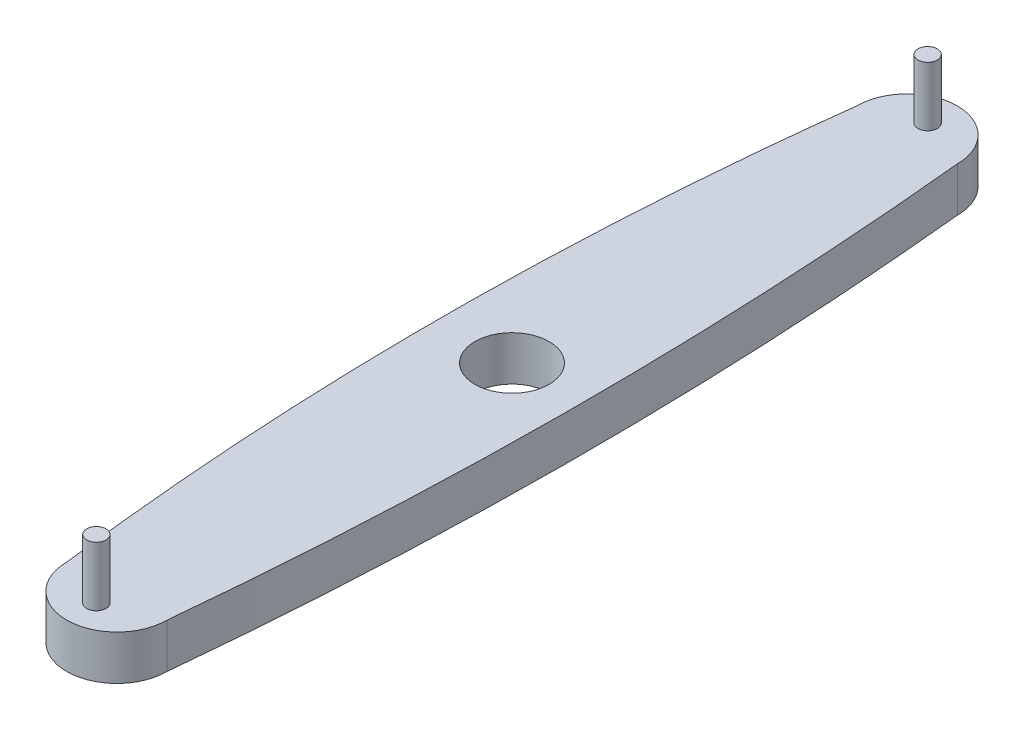
ISO-10303-21;
HEADER;
FILE_DESCRIPTION(('STEP AP214'),'2;1');
FILE_NAME('part.step','',(''),(''),'','','');
FILE_SCHEMA(('AUTOMOTIVE_DESIGN { 1 0 10303 214 1 1 1 1 }'));
ENDSEC;
DATA;
#1=APPLICATION_CONTEXT('core data for automotive mechanical design processes');
#2=APPLICATION_PROTOCOL_DEFINITION('international standard','automotive_design',2000,#1);
#3=PRODUCT_CONTEXT('',#1,'mechanical');
#4=PRODUCT('Part','Part','',(#3));
#5=PRODUCT_RELATED_PRODUCT_CATEGORY('part','',(#4));
#6=PRODUCT_DEFINITION_FORMATION('','',#4);
#7=PRODUCT_DEFINITION_CONTEXT('part definition',#1,'design');
#8=PRODUCT_DEFINITION('design','',#6,#7);
#9=PRODUCT_DEFINITION_SHAPE('','',#8);
#10=(LENGTH_UNIT() NAMED_UNIT(*) SI_UNIT(.MILLI.,.METRE.));
#11=(NAMED_UNIT(*) PLANE_ANGLE_UNIT() SI_UNIT($,.RADIAN.));
#12=(NAMED_UNIT(*) SI_UNIT($,.STERADIAN.) SOLID_ANGLE_UNIT());
#13=UNCERTAINTY_MEASURE_WITH_UNIT(LENGTH_MEASURE(1.E-05),#10,'distance_accuracy_value','');
#14=(GEOMETRIC_REPRESENTATION_CONTEXT(3) GLOBAL_UNCERTAINTY_ASSIGNED_CONTEXT((#13)) GLOBAL_UNIT_ASSIGNED_CONTEXT((#10,
#11,#12)) REPRESENTATION_CONTEXT('',''));
#15=CARTESIAN_POINT('',(0.,0.,0.));
#16=DIRECTION('',(0.,0.,1.));
#17=DIRECTION('',(1.,0.,0.));
#18=AXIS2_PLACEMENT_3D('',#15,#16,#17);
#19=CARTESIAN_POINT('',(0.,30.,266.179413915618));
#20=DIRECTION('',(0.,-1.,0.));
#21=DIRECTION('',(0.,0.,-1.));
#22=AXIS2_PLACEMENT_3D('',#19,#20,#21);
#23=CYLINDRICAL_SURFACE('',#22,33.8205860843821);
#24=CARTESIAN_POINT('',(0.,0.,266.179413915618));
#25=DIRECTION('',(0.,1.,0.));
#26=DIRECTION('',(0.,0.,-1.));
#27=AXIS2_PLACEMENT_3D('',#24,#25,#26);
#28=CIRCLE('',#27,33.8205860843821);
#29=CARTESIAN_POINT('',(-33.8205860843821,0.,266.179413915618));
#30=VERTEX_POINT('',#29);
#31=CARTESIAN_POINT('',(33.8205860843821,0.,266.179413915618));
#32=VERTEX_POINT('',#31);
#33=EDGE_CURVE('E131',#30,#32,#28,.T.);
#34=ORIENTED_EDGE('',*,*,#33,.T.);
#35=DIRECTION('',(0.,-1.,0.));
#36=VECTOR('',#35,1.);
#37=CARTESIAN_POINT('',(33.8205860843821,30.,266.179413915618));
#38=LINE('',#37,#36);
#39=CARTESIAN_POINT('',(33.8205860843821,30.,266.179413915618));
#40=VERTEX_POINT('',#39);
#41=EDGE_CURVE('E63',#40,#32,#38,.T.);
#42=ORIENTED_EDGE('',*,*,#41,.F.);
#43=CARTESIAN_POINT('',(0.,30.,266.179413915618));
#44=DIRECTION('',(0.,1.,0.));
#45=DIRECTION('',(0.,0.,-1.));
#46=AXIS2_PLACEMENT_3D('',#43,#44,#45);
#47=CIRCLE('',#46,33.8205860843821);
#48=CARTESIAN_POINT('',(-33.8205860843821,30.,266.179413915618));
#49=VERTEX_POINT('',#48);
#50=EDGE_CURVE('E98',#49,#40,#47,.T.);
#51=ORIENTED_EDGE('',*,*,#50,.F.);
#52=DIRECTION('',(0.,-1.,0.));
#53=VECTOR('',#52,1.);
#54=CARTESIAN_POINT('',(-33.8205860843821,30.,266.179413915618));
#55=LINE('',#54,#53);
#56=EDGE_CURVE('E83',#49,#30,#55,.T.);
#57=ORIENTED_EDGE('',*,*,#56,.T.);
#58=EDGE_LOOP('',(#34,#42,#51,#57));
#59=FACE_BOUND('',#58,.T.);
#60=ADVANCED_FACE('F39',(#59),#23,.T.);
#61=CARTESIAN_POINT('',(0.,30.,-266.179413915618));
#62=DIRECTION('',(0.,-1.,0.));
#63=DIRECTION('',(0.,0.,-1.));
#64=AXIS2_PLACEMENT_3D('',#61,#62,#63);
#65=CYLINDRICAL_SURFACE('',#64,33.8205860843821);
#66=CARTESIAN_POINT('',(0.,0.,-266.179413915618));
#67=DIRECTION('',(0.,1.,0.));
#68=DIRECTION('',(0.,0.,1.));
#69=AXIS2_PLACEMENT_3D('',#66,#67,#68);
#70=CIRCLE('',#69,33.8205860843821);
#71=CARTESIAN_POINT('',(33.8205860843821,0.,-266.179413915618));
#72=VERTEX_POINT('',#71);
#73=CARTESIAN_POINT('',(-33.8205860843821,0.,-266.179413915618));
#74=VERTEX_POINT('',#73);
#75=EDGE_CURVE('E103',#72,#74,#70,.T.);
#76=ORIENTED_EDGE('',*,*,#75,.T.);
#77=DIRECTION('',(0.,-1.,0.));
#78=VECTOR('',#77,1.);
#79=CARTESIAN_POINT('',(-33.8205860843821,30.,-266.179413915618));
#80=LINE('',#79,#78);
#81=CARTESIAN_POINT('',(-33.8205860843821,30.,-266.179413915618));
#82=VERTEX_POINT('',#81);
#83=EDGE_CURVE('E55',#82,#74,#80,.T.);
#84=ORIENTED_EDGE('',*,*,#83,.F.);
#85=CARTESIAN_POINT('',(0.,30.,-266.179413915618));
#86=DIRECTION('',(0.,1.,0.));
#87=DIRECTION('',(0.,0.,1.));
#88=AXIS2_PLACEMENT_3D('',#85,#86,#87);
#89=CIRCLE('',#88,33.8205860843821);
#90=CARTESIAN_POINT('',(33.8205860843821,30.,-266.179413915618));
#91=VERTEX_POINT('',#90);
#92=EDGE_CURVE('E93',#91,#82,#89,.T.);
#93=ORIENTED_EDGE('',*,*,#92,.F.);
#94=DIRECTION('',(0.,-1.,0.));
#95=VECTOR('',#94,1.);
#96=CARTESIAN_POINT('',(33.8205860843821,30.,-266.179413915618));
#97=LINE('',#96,#95);
#98=EDGE_CURVE('E105',#91,#72,#97,.T.);
#99=ORIENTED_EDGE('',*,*,#98,.T.);
#100=EDGE_LOOP('',(#76,#84,#93,#99));
#101=FACE_BOUND('',#100,.T.);
#102=ADVANCED_FACE('F101',(#101),#65,.T.);
#103=CARTESIAN_POINT('',(0.,30.,266.179413915618));
#104=DIRECTION('',(0.,-1.,0.));
#105=DIRECTION('',(0.,0.,-1.));
#106=AXIS2_PLACEMENT_3D('',#103,#104,#105);
#107=PLANE('',#106);
#108=CARTESIAN_POINT('',(0.,30.,-280.));
#109=DIRECTION('',(0.,-1.,0.));
#110=DIRECTION('',(0.,0.,-1.));
#111=AXIS2_PLACEMENT_3D('',#108,#109,#110);
#112=CIRCLE('',#111,6.505);
#113=CARTESIAN_POINT('',(0.,30.,-286.505));
#114=VERTEX_POINT('',#113);
#115=EDGE_CURVE('E88',#114,#114,#112,.T.);
#116=ORIENTED_EDGE('',*,*,#115,.T.);
#117=EDGE_LOOP('',(#116));
#118=FACE_BOUND('',#117,.T.);
#119=CARTESIAN_POINT('',(0.,30.,280.));
#120=DIRECTION('',(0.,-1.,0.));
#121=DIRECTION('',(0.,0.,-1.));
#122=AXIS2_PLACEMENT_3D('',#119,#120,#121);
#123=CIRCLE('',#122,6.505);
#124=CARTESIAN_POINT('',(0.,30.,273.495));
#125=VERTEX_POINT('',#124);
#126=EDGE_CURVE('E114',#125,#125,#123,.F.);
#127=ORIENTED_EDGE('',*,*,#126,.F.);
#128=EDGE_LOOP('',(#127));
#129=FACE_BOUND('',#128,.T.);
#130=CARTESIAN_POINT('',(0.,30.,0.));
#131=DIRECTION('',(0.,1.,0.));
#132=DIRECTION('',(0.,0.,1.));
#133=AXIS2_PLACEMENT_3D('',#130,#131,#132);
#134=CIRCLE('',#133,25.);
#135=CARTESIAN_POINT('',(0.,30.,25.));
#136=VERTEX_POINT('',#135);
#137=EDGE_CURVE('E140',#136,#136,#134,.T.);
#138=ORIENTED_EDGE('',*,*,#137,.F.);
#139=EDGE_LOOP('',(#138));
#140=FACE_BOUND('',#139,.T.);
#141=ORIENTED_EDGE('',*,*,#92,.T.);
#142=CARTESIAN_POINT('',(-33.8205860843821,30.,266.179413915618));
#143=CARTESIAN_POINT('',(-66.8420022981913,30.,0.));
#144=CARTESIAN_POINT('',(-33.8205860843821,30.,-266.179413915618));
#145=B_SPLINE_CURVE_WITH_KNOTS('',2,(#142,#143,#144),.UNSPECIFIED.,.F.,.F.,(3,3),(0.,1.),.UNSPECIFIED.);
#146=EDGE_CURVE('E79',#49,#82,#145,.T.);
#147=ORIENTED_EDGE('',*,*,#146,.F.);
#148=ORIENTED_EDGE('',*,*,#50,.T.);
#149=CARTESIAN_POINT('',(33.8205860843821,30.,-266.179413915618));
#150=CARTESIAN_POINT('',(60.1278621899774,30.,0.0301871194506127));
#151=CARTESIAN_POINT('',(33.8205860843821,30.,266.179413915618));
#152=B_SPLINE_CURVE_WITH_KNOTS('',2,(#149,#150,#151),.UNSPECIFIED.,.F.,.F.,(3,3),(0.,1.),.UNSPECIFIED.);
#153=EDGE_CURVE('E89',#91,#40,#152,.T.);
#154=ORIENTED_EDGE('',*,*,#153,.F.);
#155=EDGE_LOOP('',(#141,#147,#148,#154));
#156=FACE_BOUND('',#155,.T.);
#157=ADVANCED_FACE('F94',(#118,#129,#140,#156),#107,.F.);
#158=CARTESIAN_POINT('',(0.,0.,266.179413915618));
#159=DIRECTION('',(0.,-1.,0.));
#160=DIRECTION('',(0.,0.,-1.));
#161=AXIS2_PLACEMENT_3D('',#158,#159,#160);
#162=PLANE('',#161);
#163=CARTESIAN_POINT('',(-33.8205860843821,0.,266.179413915618));
#164=CARTESIAN_POINT('',(-66.8420022981913,0.,0.));
#165=CARTESIAN_POINT('',(-33.8205860843821,0.,-266.179413915618));
#166=B_SPLINE_CURVE_WITH_KNOTS('',2,(#163,#164,#165),.UNSPECIFIED.,.F.,.F.,(3,3),(0.,1.),.UNSPECIFIED.);
#167=EDGE_CURVE('E11',#74,#30,#166,.F.);
#168=ORIENTED_EDGE('',*,*,#167,.F.);
#169=ORIENTED_EDGE('',*,*,#75,.F.);
#170=CARTESIAN_POINT('',(33.8205860843821,0.,-266.179413915618));
#171=CARTESIAN_POINT('',(60.1278621899774,0.,0.0301871194506127));
#172=CARTESIAN_POINT('',(33.8205860843821,0.,266.179413915618));
#173=B_SPLINE_CURVE_WITH_KNOTS('',2,(#170,#171,#172),.UNSPECIFIED.,.F.,.F.,(3,3),(0.,1.),.UNSPECIFIED.);
#174=EDGE_CURVE('E48',#32,#72,#173,.F.);
#175=ORIENTED_EDGE('',*,*,#174,.F.);
#176=ORIENTED_EDGE('',*,*,#33,.F.);
#177=EDGE_LOOP('',(#168,#169,#175,#176));
#178=FACE_BOUND('',#177,.T.);
#179=CARTESIAN_POINT('',(0.,0.,0.));
#180=DIRECTION('',(0.,1.,0.));
#181=DIRECTION('',(0.,0.,1.));
#182=AXIS2_PLACEMENT_3D('',#179,#180,#181);
#183=CIRCLE('',#182,25.);
#184=CARTESIAN_POINT('',(0.,0.,25.));
#185=VERTEX_POINT('',#184);
#186=EDGE_CURVE('E136',#185,#185,#183,.T.);
#187=ORIENTED_EDGE('',*,*,#186,.T.);
#188=EDGE_LOOP('',(#187));
#189=FACE_BOUND('',#188,.T.);
#190=ADVANCED_FACE('F209',(#178,#189),#162,.T.);
#191=CARTESIAN_POINT('',(0.,0.,0.));
#192=DIRECTION('',(0.,1.,0.));
#193=DIRECTION('',(0.,0.,1.));
#194=AXIS2_PLACEMENT_3D('',#191,#192,#193);
#195=CYLINDRICAL_SURFACE('',#194,25.);
#196=ORIENTED_EDGE('',*,*,#186,.F.);
#197=EDGE_LOOP('',(#196));
#198=FACE_BOUND('',#197,.T.);
#199=ORIENTED_EDGE('',*,*,#137,.T.);
#200=EDGE_LOOP('',(#199));
#201=FACE_BOUND('',#200,.T.);
#202=ADVANCED_FACE('F205',(#198,#201),#195,.F.);
#203=CARTESIAN_POINT('',(0.,70.,280.));
#204=DIRECTION('',(0.,-1.,0.));
#205=DIRECTION('',(0.,0.,-1.));
#206=AXIS2_PLACEMENT_3D('',#203,#204,#205);
#207=CYLINDRICAL_SURFACE('',#206,6.505);
#208=CARTESIAN_POINT('',(0.,70.,280.));
#209=DIRECTION('',(0.,1.,0.));
#210=DIRECTION('',(0.,0.,1.));
#211=AXIS2_PLACEMENT_3D('',#208,#209,#210);
#212=CIRCLE('',#211,6.505);
#213=CARTESIAN_POINT('',(0.,70.,286.505));
#214=VERTEX_POINT('',#213);
#215=EDGE_CURVE('E157',#214,#214,#212,.T.);
#216=ORIENTED_EDGE('',*,*,#215,.F.);
#217=EDGE_LOOP('',(#216));
#218=FACE_BOUND('',#217,.T.);
#219=ORIENTED_EDGE('',*,*,#126,.T.);
#220=EDGE_LOOP('',(#219));
#221=FACE_BOUND('',#220,.T.);
#222=ADVANCED_FACE('F201',(#218,#221),#207,.T.);
#223=CARTESIAN_POINT('',(0.,70.,280.));
#224=DIRECTION('',(0.,1.,0.));
#225=DIRECTION('',(0.,0.,1.));
#226=AXIS2_PLACEMENT_3D('',#223,#224,#225);
#227=PLANE('',#226);
#228=ORIENTED_EDGE('',*,*,#215,.T.);
#229=EDGE_LOOP('',(#228));
#230=FACE_BOUND('',#229,.T.);
#231=ADVANCED_FACE('F197',(#230),#227,.T.);
#232=CARTESIAN_POINT('',(0.,70.,-280.));
#233=DIRECTION('',(0.,-1.,0.));
#234=DIRECTION('',(0.,0.,-1.));
#235=AXIS2_PLACEMENT_3D('',#232,#233,#234);
#236=CYLINDRICAL_SURFACE('',#235,6.505);
#237=CARTESIAN_POINT('',(0.,70.,-280.));
#238=DIRECTION('',(0.,-1.,0.));
#239=DIRECTION('',(0.,0.,-1.));
#240=AXIS2_PLACEMENT_3D('',#237,#238,#239);
#241=CIRCLE('',#240,6.505);
#242=CARTESIAN_POINT('',(0.,70.,-286.505));
#243=VERTEX_POINT('',#242);
#244=EDGE_CURVE('E162',#243,#243,#241,.T.);
#245=ORIENTED_EDGE('',*,*,#244,.T.);
#246=EDGE_LOOP('',(#245));
#247=FACE_BOUND('',#246,.T.);
#248=ORIENTED_EDGE('',*,*,#115,.F.);
#249=EDGE_LOOP('',(#248));
#250=FACE_BOUND('',#249,.T.);
#251=ADVANCED_FACE('F193',(#247,#250),#236,.T.);
#252=CARTESIAN_POINT('',(0.,70.,-280.));
#253=DIRECTION('',(0.,1.,0.));
#254=DIRECTION('',(0.,0.,-1.));
#255=AXIS2_PLACEMENT_3D('',#252,#253,#254);
#256=PLANE('',#255);
#257=ORIENTED_EDGE('',*,*,#244,.F.);
#258=EDGE_LOOP('',(#257));
#259=FACE_BOUND('',#258,.T.);
#260=ADVANCED_FACE('F190',(#259),#256,.T.);
#261=CARTESIAN_POINT('',(33.8205860843821,-10.,-266.179413915618));
#262=CARTESIAN_POINT('',(60.1278621899774,-10.,0.0301871194506127));
#263=CARTESIAN_POINT('',(33.8205860843821,-10.,266.179413915618));
#264=B_SPLINE_CURVE_WITH_KNOTS('',2,(#261,#262,#263),.UNSPECIFIED.,.F.,.F.,(3,3),(0.,1.),.UNSPECIFIED.);
#265=DIRECTION('',(0.,1.,0.));
#266=VECTOR('',#265,1.);
#267=SURFACE_OF_LINEAR_EXTRUSION('',#264,#266);
#268=ORIENTED_EDGE('',*,*,#174,.T.);
#269=ORIENTED_EDGE('',*,*,#98,.F.);
#270=ORIENTED_EDGE('',*,*,#153,.T.);
#271=ORIENTED_EDGE('',*,*,#41,.T.);
#272=EDGE_LOOP('',(#268,#269,#270,#271));
#273=FACE_BOUND('',#272,.T.);
#274=ADVANCED_FACE('F186',(#273),#267,.F.);
#275=CARTESIAN_POINT('',(-33.8205860843821,-10.,266.179413915618));
#276=CARTESIAN_POINT('',(-66.8420022981913,-10.,0.));
#277=CARTESIAN_POINT('',(-33.8205860843821,-10.,-266.179413915618));
#278=B_SPLINE_CURVE_WITH_KNOTS('',2,(#275,#276,#277),.UNSPECIFIED.,.F.,.F.,(3,3),(0.,1.),.UNSPECIFIED.);
#279=DIRECTION('',(0.,1.,0.));
#280=VECTOR('',#279,1.);
#281=SURFACE_OF_LINEAR_EXTRUSION('',#278,#280);
#282=ORIENTED_EDGE('',*,*,#167,.T.);
#283=ORIENTED_EDGE('',*,*,#56,.F.);
#284=ORIENTED_EDGE('',*,*,#146,.T.);
#285=ORIENTED_EDGE('',*,*,#83,.T.);
#286=EDGE_LOOP('',(#282,#283,#284,#285));
#287=FACE_BOUND('',#286,.T.);
#288=ADVANCED_FACE('F81',(#287),#281,.F.);
#289=CLOSED_SHELL('',(#60,#102,#157,#190,#202,#222,#231,#251,#260,#274,#288));
#290=MANIFOLD_SOLID_BREP('B2',#289);
#291=ADVANCED_BREP_SHAPE_REPRESENTATION('',(#18,#290),#14);
#292=SHAPE_DEFINITION_REPRESENTATION(#9,#291);
ENDSEC;
END-ISO-10303-21;
